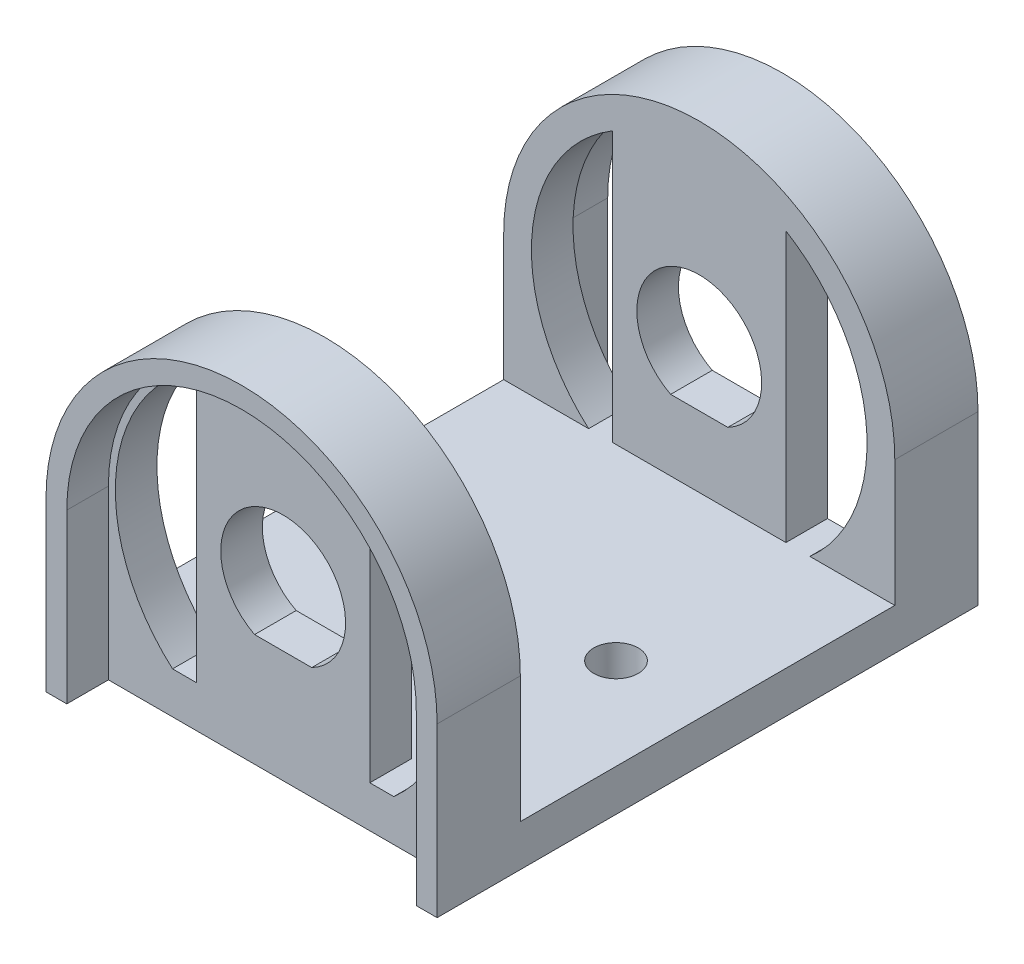
ISO-10303-21;
HEADER;
FILE_DESCRIPTION(('STEP AP214'),'2;1');
FILE_NAME('part.step','',(''),(''),'','','');
FILE_SCHEMA(('AUTOMOTIVE_DESIGN { 1 0 10303 214 1 1 1 1 }'));
ENDSEC;
DATA;
#1=APPLICATION_CONTEXT('core data for automotive mechanical design processes');
#2=APPLICATION_PROTOCOL_DEFINITION('international standard','automotive_design',2000,#1);
#3=PRODUCT_CONTEXT('',#1,'mechanical');
#4=PRODUCT('Part','Part','',(#3));
#5=PRODUCT_RELATED_PRODUCT_CATEGORY('part','',(#4));
#6=PRODUCT_DEFINITION_FORMATION('','',#4);
#7=PRODUCT_DEFINITION_CONTEXT('part definition',#1,'design');
#8=PRODUCT_DEFINITION('design','',#6,#7);
#9=PRODUCT_DEFINITION_SHAPE('','',#8);
#10=(LENGTH_UNIT() NAMED_UNIT(*) SI_UNIT(.MILLI.,.METRE.));
#11=(NAMED_UNIT(*) PLANE_ANGLE_UNIT() SI_UNIT($,.RADIAN.));
#12=(NAMED_UNIT(*) SI_UNIT($,.STERADIAN.) SOLID_ANGLE_UNIT());
#13=UNCERTAINTY_MEASURE_WITH_UNIT(LENGTH_MEASURE(1.E-05),#10,'distance_accuracy_value','');
#14=(GEOMETRIC_REPRESENTATION_CONTEXT(3) GLOBAL_UNCERTAINTY_ASSIGNED_CONTEXT((#13)) GLOBAL_UNIT_ASSIGNED_CONTEXT((#10,
#11,#12)) REPRESENTATION_CONTEXT('',''));
#15=CARTESIAN_POINT('',(0.,0.,0.));
#16=DIRECTION('',(0.,0.,1.));
#17=DIRECTION('',(1.,0.,0.));
#18=AXIS2_PLACEMENT_3D('',#15,#16,#17);
#19=CARTESIAN_POINT('',(0.,-10.1,19.5));
#20=DIRECTION('',(0.,-1.,0.));
#21=DIRECTION('',(0.,0.,-1.));
#22=AXIS2_PLACEMENT_3D('',#19,#20,#21);
#23=PLANE('',#22);
#24=CARTESIAN_POINT('',(7.5,-10.1,0.));
#25=DIRECTION('',(0.,-1.,0.));
#26=DIRECTION('',(0.,0.,-1.));
#27=AXIS2_PLACEMENT_3D('',#24,#25,#26);
#28=CIRCLE('',#27,1.6);
#29=CARTESIAN_POINT('',(7.5,-10.1,-1.6));
#30=VERTEX_POINT('',#29);
#31=EDGE_CURVE('E337',#30,#30,#28,.T.);
#32=ORIENTED_EDGE('',*,*,#31,.T.);
#33=EDGE_LOOP('',(#32));
#34=FACE_BOUND('',#33,.T.);
#35=CARTESIAN_POINT('',(-7.5,-10.1,0.));
#36=DIRECTION('',(0.,-1.,0.));
#37=DIRECTION('',(0.,0.,-1.));
#38=AXIS2_PLACEMENT_3D('',#35,#36,#37);
#39=CIRCLE('',#38,1.6);
#40=CARTESIAN_POINT('',(-7.5,-10.1,-1.6));
#41=VERTEX_POINT('',#40);
#42=EDGE_CURVE('E329',#41,#41,#39,.T.);
#43=ORIENTED_EDGE('',*,*,#42,.T.);
#44=EDGE_LOOP('',(#43));
#45=FACE_BOUND('',#44,.T.);
#46=DIRECTION('',(1.,0.,0.));
#47=VECTOR('',#46,1.);
#48=CARTESIAN_POINT('',(0.,-10.1,-16.5));
#49=LINE('',#48,#47);
#50=CARTESIAN_POINT('',(-7.97496081495075,-10.1,-16.5));
#51=VERTEX_POINT('',#50);
#52=CARTESIAN_POINT('',(-6.25,-10.1,-16.5));
#53=VERTEX_POINT('',#52);
#54=EDGE_CURVE('E59',#51,#53,#49,.T.);
#55=ORIENTED_EDGE('',*,*,#54,.F.);
#56=DIRECTION('',(0.,0.,-1.));
#57=VECTOR('',#56,1.);
#58=CARTESIAN_POINT('',(-7.97496081495075,-10.1,19.5));
#59=LINE('',#58,#57);
#60=CARTESIAN_POINT('',(-7.97496081495075,-10.1,-13.5));
#61=VERTEX_POINT('',#60);
#62=EDGE_CURVE('E549',#61,#51,#59,.T.);
#63=ORIENTED_EDGE('',*,*,#62,.F.);
#64=DIRECTION('',(1.,0.,0.));
#65=VECTOR('',#64,1.);
#66=CARTESIAN_POINT('',(-14.1,-10.1,-13.5));
#67=LINE('',#66,#65);
#68=CARTESIAN_POINT('',(-14.1,-10.1,-13.5));
#69=VERTEX_POINT('',#68);
#70=EDGE_CURVE('E430',#69,#61,#67,.T.);
#71=ORIENTED_EDGE('',*,*,#70,.F.);
#72=DIRECTION('',(0.,0.,-1.));
#73=VECTOR('',#72,1.);
#74=CARTESIAN_POINT('',(-14.1,-10.1,-13.5));
#75=LINE('',#74,#73);
#76=CARTESIAN_POINT('',(-14.1,-10.1,13.5));
#77=VERTEX_POINT('',#76);
#78=EDGE_CURVE('E421',#77,#69,#75,.T.);
#79=ORIENTED_EDGE('',*,*,#78,.F.);
#80=DIRECTION('',(1.,0.,0.));
#81=VECTOR('',#80,1.);
#82=CARTESIAN_POINT('',(-14.1,-10.1,13.5));
#83=LINE('',#82,#81);
#84=CARTESIAN_POINT('',(-7.97496081495075,-10.1,13.5));
#85=VERTEX_POINT('',#84);
#86=EDGE_CURVE('E436',#77,#85,#83,.T.);
#87=ORIENTED_EDGE('',*,*,#86,.T.);
#88=CARTESIAN_POINT('',(-7.97496081495075,-10.1,16.5));
#89=VERTEX_POINT('',#88);
#90=EDGE_CURVE('E545',#89,#85,#59,.T.);
#91=ORIENTED_EDGE('',*,*,#90,.F.);
#92=DIRECTION('',(-1.,0.,0.));
#93=VECTOR('',#92,1.);
#94=CARTESIAN_POINT('',(0.,-10.1,16.5));
#95=LINE('',#94,#93);
#96=CARTESIAN_POINT('',(-6.25,-10.1,16.5));
#97=VERTEX_POINT('',#96);
#98=EDGE_CURVE('E395',#97,#89,#95,.T.);
#99=ORIENTED_EDGE('',*,*,#98,.F.);
#100=DIRECTION('',(0.,0.,-1.));
#101=VECTOR('',#100,1.);
#102=CARTESIAN_POINT('',(-6.25,-10.1,19.5));
#103=LINE('',#102,#101);
#104=CARTESIAN_POINT('',(-6.25,-10.1,13.5));
#105=VERTEX_POINT('',#104);
#106=EDGE_CURVE('E550',#97,#105,#103,.T.);
#107=ORIENTED_EDGE('',*,*,#106,.T.);
#108=CARTESIAN_POINT('',(6.24999999999999,-10.1,13.5));
#109=VERTEX_POINT('',#108);
#110=EDGE_CURVE('E440',#105,#109,#83,.T.);
#111=ORIENTED_EDGE('',*,*,#110,.T.);
#112=DIRECTION('',(0.,0.,-1.));
#113=VECTOR('',#112,1.);
#114=CARTESIAN_POINT('',(6.25,-10.1,19.5));
#115=LINE('',#114,#113);
#116=CARTESIAN_POINT('',(6.25,-10.1,16.5));
#117=VERTEX_POINT('',#116);
#118=EDGE_CURVE('E539',#117,#109,#115,.T.);
#119=ORIENTED_EDGE('',*,*,#118,.F.);
#120=CARTESIAN_POINT('',(7.97496081495075,-10.1,16.5));
#121=VERTEX_POINT('',#120);
#122=EDGE_CURVE('E391',#121,#117,#95,.T.);
#123=ORIENTED_EDGE('',*,*,#122,.F.);
#124=DIRECTION('',(0.,0.,-1.));
#125=VECTOR('',#124,1.);
#126=CARTESIAN_POINT('',(7.97496081495075,-10.1,19.5));
#127=LINE('',#126,#125);
#128=CARTESIAN_POINT('',(7.97496081495074,-10.1,13.5));
#129=VERTEX_POINT('',#128);
#130=EDGE_CURVE('E521',#121,#129,#127,.T.);
#131=ORIENTED_EDGE('',*,*,#130,.T.);
#132=CARTESIAN_POINT('',(14.1,-10.1,13.5));
#133=VERTEX_POINT('',#132);
#134=EDGE_CURVE('E429',#129,#133,#83,.T.);
#135=ORIENTED_EDGE('',*,*,#134,.T.);
#136=DIRECTION('',(0.,0.,-1.));
#137=VECTOR('',#136,1.);
#138=CARTESIAN_POINT('',(14.1,-10.1,-13.5));
#139=LINE('',#138,#137);
#140=CARTESIAN_POINT('',(14.1,-10.1,-13.5));
#141=VERTEX_POINT('',#140);
#142=EDGE_CURVE('E409',#133,#141,#139,.T.);
#143=ORIENTED_EDGE('',*,*,#142,.T.);
#144=CARTESIAN_POINT('',(7.97496081495074,-10.1,-13.5));
#145=VERTEX_POINT('',#144);
#146=EDGE_CURVE('E435',#145,#141,#67,.T.);
#147=ORIENTED_EDGE('',*,*,#146,.F.);
#148=CARTESIAN_POINT('',(7.97496081495075,-10.1,-16.5));
#149=VERTEX_POINT('',#148);
#150=EDGE_CURVE('E542',#145,#149,#127,.T.);
#151=ORIENTED_EDGE('',*,*,#150,.T.);
#152=CARTESIAN_POINT('',(6.25,-10.1,-16.5));
#153=VERTEX_POINT('',#152);
#154=EDGE_CURVE('E315',#153,#149,#49,.T.);
#155=ORIENTED_EDGE('',*,*,#154,.F.);
#156=CARTESIAN_POINT('',(6.25,-10.1,-13.5));
#157=VERTEX_POINT('',#156);
#158=EDGE_CURVE('E537',#157,#153,#115,.T.);
#159=ORIENTED_EDGE('',*,*,#158,.F.);
#160=CARTESIAN_POINT('',(-6.25000000000001,-10.1,-13.5));
#161=VERTEX_POINT('',#160);
#162=EDGE_CURVE('E434',#161,#157,#67,.T.);
#163=ORIENTED_EDGE('',*,*,#162,.F.);
#164=EDGE_CURVE('E548',#161,#53,#103,.T.);
#165=ORIENTED_EDGE('',*,*,#164,.T.);
#166=EDGE_LOOP('',(#55,#63,#71,#79,#87,#91,#99,#107,#111,#119,#123,#131,#135,#143,#147,#151,
#155,#159,#163,#165));
#167=FACE_BOUND('',#166,.T.);
#168=ADVANCED_FACE('F43',(#34,#45,#167),#23,.F.);
#169=CARTESIAN_POINT('',(0.,-0.999999999999997,19.5));
#170=DIRECTION('',(0.,0.,-1.));
#171=DIRECTION('',(-1.,0.,0.));
#172=AXIS2_PLACEMENT_3D('',#169,#170,#171);
#173=CYLINDRICAL_SURFACE('',#172,12.1);
#174=DIRECTION('',(0.,0.,-1.));
#175=VECTOR('',#174,1.);
#176=CARTESIAN_POINT('',(6.25,9.36086386359747,19.5));
#177=LINE('',#176,#175);
#178=CARTESIAN_POINT('',(6.25,9.36086386359747,-13.5));
#179=VERTEX_POINT('',#178);
#180=CARTESIAN_POINT('',(6.25,9.36086386359747,-16.5));
#181=VERTEX_POINT('',#180);
#182=EDGE_CURVE('E538',#179,#181,#177,.T.);
#183=ORIENTED_EDGE('',*,*,#182,.T.);
#184=CARTESIAN_POINT('',(0.,-0.999999999999997,-16.5));
#185=DIRECTION('',(0.,0.,-1.));
#186=DIRECTION('',(-1.,0.,0.));
#187=AXIS2_PLACEMENT_3D('',#184,#185,#186);
#188=CIRCLE('',#187,12.1);
#189=EDGE_CURVE('E67',#181,#149,#188,.T.);
#190=ORIENTED_EDGE('',*,*,#189,.T.);
#191=ORIENTED_EDGE('',*,*,#150,.F.);
#192=CARTESIAN_POINT('',(0.,-0.999999999999997,-13.5));
#193=DIRECTION('',(0.,0.,-1.));
#194=DIRECTION('',(0.,1.,0.));
#195=AXIS2_PLACEMENT_3D('',#192,#193,#194);
#196=CIRCLE('',#195,12.1);
#197=EDGE_CURVE('E469',#179,#145,#196,.T.);
#198=ORIENTED_EDGE('',*,*,#197,.F.);
#199=EDGE_LOOP('',(#183,#190,#191,#198));
#200=FACE_BOUND('',#199,.T.);
#201=ADVANCED_FACE('F643',(#200),#173,.F.);
#202=CARTESIAN_POINT('',(0.,-0.999999999999997,19.5));
#203=DIRECTION('',(0.,0.,-1.));
#204=DIRECTION('',(-1.,0.,0.));
#205=AXIS2_PLACEMENT_3D('',#202,#203,#204);
#206=CYLINDRICAL_SURFACE('',#205,12.1);
#207=ORIENTED_EDGE('',*,*,#62,.T.);
#208=CARTESIAN_POINT('',(0.,-0.999999999999997,-16.5));
#209=DIRECTION('',(0.,0.,-1.));
#210=DIRECTION('',(-1.,0.,0.));
#211=AXIS2_PLACEMENT_3D('',#208,#209,#210);
#212=CIRCLE('',#211,12.1);
#213=CARTESIAN_POINT('',(-6.25,9.36086386359747,-16.5));
#214=VERTEX_POINT('',#213);
#215=EDGE_CURVE('E321',#51,#214,#212,.T.);
#216=ORIENTED_EDGE('',*,*,#215,.T.);
#217=DIRECTION('',(0.,0.,-1.));
#218=VECTOR('',#217,1.);
#219=CARTESIAN_POINT('',(-6.25,9.36086386359747,19.5));
#220=LINE('',#219,#218);
#221=CARTESIAN_POINT('',(-6.25,9.36086386359747,-13.5));
#222=VERTEX_POINT('',#221);
#223=EDGE_CURVE('E553',#222,#214,#220,.T.);
#224=ORIENTED_EDGE('',*,*,#223,.F.);
#225=CARTESIAN_POINT('',(0.,-0.999999999999997,-13.5));
#226=DIRECTION('',(0.,0.,-1.));
#227=DIRECTION('',(0.,1.,0.));
#228=AXIS2_PLACEMENT_3D('',#225,#226,#227);
#229=CIRCLE('',#228,12.1);
#230=EDGE_CURVE('E476',#61,#222,#229,.T.);
#231=ORIENTED_EDGE('',*,*,#230,.F.);
#232=EDGE_LOOP('',(#207,#216,#224,#231));
#233=FACE_BOUND('',#232,.T.);
#234=ADVANCED_FACE('F638',(#233),#206,.F.);
#235=CARTESIAN_POINT('',(-6.25,0.,19.5));
#236=DIRECTION('',(1.,0.,0.));
#237=DIRECTION('',(0.,1.,0.));
#238=AXIS2_PLACEMENT_3D('',#235,#236,#237);
#239=PLANE('',#238);
#240=DIRECTION('',(0.,1.,0.));
#241=VECTOR('',#240,1.);
#242=CARTESIAN_POINT('',(-6.25,0.,-16.5));
#243=LINE('',#242,#241);
#244=EDGE_CURVE('E318',#53,#214,#243,.T.);
#245=ORIENTED_EDGE('',*,*,#244,.F.);
#246=ORIENTED_EDGE('',*,*,#164,.F.);
#247=DIRECTION('',(0.,1.,0.));
#248=VECTOR('',#247,1.);
#249=CARTESIAN_POINT('',(-6.25,0.,-13.5));
#250=LINE('',#249,#248);
#251=EDGE_CURVE('E472',#161,#222,#250,.T.);
#252=ORIENTED_EDGE('',*,*,#251,.T.);
#253=ORIENTED_EDGE('',*,*,#223,.T.);
#254=EDGE_LOOP('',(#245,#246,#252,#253));
#255=FACE_BOUND('',#254,.T.);
#256=ADVANCED_FACE('F629',(#255),#239,.F.);
#257=CARTESIAN_POINT('',(0.,-0.999999999999869,19.5));
#258=DIRECTION('',(0.,0.,-1.));
#259=DIRECTION('',(-1.,0.,0.));
#260=AXIS2_PLACEMENT_3D('',#257,#258,#259);
#261=CYLINDRICAL_SURFACE('',#260,4.5);
#262=DIRECTION('',(0.,0.,-1.));
#263=VECTOR('',#262,1.);
#264=CARTESIAN_POINT('',(-2.06155281280883,-4.99999999999987,19.5));
#265=LINE('',#264,#263);
#266=CARTESIAN_POINT('',(-2.06155281280883,-4.99999999999987,-13.5));
#267=VERTEX_POINT('',#266);
#268=CARTESIAN_POINT('',(-2.06155281280883,-4.99999999999987,-16.5));
#269=VERTEX_POINT('',#268);
#270=EDGE_CURVE('E500',#267,#269,#265,.T.);
#271=ORIENTED_EDGE('',*,*,#270,.T.);
#272=CARTESIAN_POINT('',(0.,-0.999999999999869,-16.5));
#273=DIRECTION('',(0.,0.,-1.));
#274=DIRECTION('',(-1.,0.,0.));
#275=AXIS2_PLACEMENT_3D('',#272,#273,#274);
#276=CIRCLE('',#275,4.5);
#277=CARTESIAN_POINT('',(2.06155281280883,-4.99999999999987,-16.5));
#278=VERTEX_POINT('',#277);
#279=EDGE_CURVE('E306',#269,#278,#276,.T.);
#280=ORIENTED_EDGE('',*,*,#279,.T.);
#281=DIRECTION('',(0.,0.,-1.));
#282=VECTOR('',#281,1.);
#283=CARTESIAN_POINT('',(2.06155281280883,-4.99999999999987,19.5));
#284=LINE('',#283,#282);
#285=CARTESIAN_POINT('',(2.06155281280883,-4.99999999999987,-13.5));
#286=VERTEX_POINT('',#285);
#287=EDGE_CURVE('E560',#286,#278,#284,.T.);
#288=ORIENTED_EDGE('',*,*,#287,.F.);
#289=CARTESIAN_POINT('',(0.,-0.999999999999869,-13.5));
#290=DIRECTION('',(0.,0.,-1.));
#291=DIRECTION('',(0.,1.,0.));
#292=AXIS2_PLACEMENT_3D('',#289,#290,#291);
#293=CIRCLE('',#292,4.5);
#294=EDGE_CURVE('E463',#267,#286,#293,.T.);
#295=ORIENTED_EDGE('',*,*,#294,.F.);
#296=EDGE_LOOP('',(#271,#280,#288,#295));
#297=FACE_BOUND('',#296,.T.);
#298=ADVANCED_FACE('F635',(#297),#261,.F.);
#299=CARTESIAN_POINT('',(6.25,0.,19.5));
#300=DIRECTION('',(1.,0.,0.));
#301=DIRECTION('',(0.,1.,0.));
#302=AXIS2_PLACEMENT_3D('',#299,#300,#301);
#303=PLANE('',#302);
#304=ORIENTED_EDGE('',*,*,#158,.T.);
#305=DIRECTION('',(0.,1.,0.));
#306=VECTOR('',#305,1.);
#307=CARTESIAN_POINT('',(6.25,0.,-16.5));
#308=LINE('',#307,#306);
#309=EDGE_CURVE('E310',#153,#181,#308,.T.);
#310=ORIENTED_EDGE('',*,*,#309,.T.);
#311=ORIENTED_EDGE('',*,*,#182,.F.);
#312=DIRECTION('',(0.,1.,0.));
#313=VECTOR('',#312,1.);
#314=CARTESIAN_POINT('',(6.25,0.,-13.5));
#315=LINE('',#314,#313);
#316=EDGE_CURVE('E466',#157,#179,#315,.T.);
#317=ORIENTED_EDGE('',*,*,#316,.F.);
#318=EDGE_LOOP('',(#304,#310,#311,#317));
#319=FACE_BOUND('',#318,.T.);
#320=ADVANCED_FACE('F658',(#319),#303,.T.);
#321=CARTESIAN_POINT('',(0.,-4.99999999999987,19.5));
#322=DIRECTION('',(0.,-1.,0.));
#323=DIRECTION('',(0.,0.,-1.));
#324=AXIS2_PLACEMENT_3D('',#321,#322,#323);
#325=PLANE('',#324);
#326=DIRECTION('',(1.,0.,0.));
#327=VECTOR('',#326,1.);
#328=CARTESIAN_POINT('',(0.,-4.99999999999987,-16.5));
#329=LINE('',#328,#327);
#330=EDGE_CURVE('E298',#269,#278,#329,.T.);
#331=ORIENTED_EDGE('',*,*,#330,.F.);
#332=ORIENTED_EDGE('',*,*,#270,.F.);
#333=DIRECTION('',(1.,0.,0.));
#334=VECTOR('',#333,1.);
#335=CARTESIAN_POINT('',(0.,-4.99999999999987,-13.5));
#336=LINE('',#335,#334);
#337=EDGE_CURVE('E11',#267,#286,#336,.T.);
#338=ORIENTED_EDGE('',*,*,#337,.T.);
#339=ORIENTED_EDGE('',*,*,#287,.T.);
#340=EDGE_LOOP('',(#331,#332,#338,#339));
#341=FACE_BOUND('',#340,.T.);
#342=ADVANCED_FACE('F670',(#341),#325,.F.);
#343=CARTESIAN_POINT('',(0.,-13.1,19.5));
#344=DIRECTION('',(0.,1.,0.));
#345=DIRECTION('',(0.,0.,1.));
#346=AXIS2_PLACEMENT_3D('',#343,#344,#345);
#347=PLANE('',#346);
#348=CARTESIAN_POINT('',(-7.5,-13.1,0.));
#349=DIRECTION('',(0.,1.,0.));
#350=DIRECTION('',(0.,0.,-1.));
#351=AXIS2_PLACEMENT_3D('',#348,#349,#350);
#352=CIRCLE('',#351,1.6);
#353=CARTESIAN_POINT('',(-7.5,-13.1,-1.6));
#354=VERTEX_POINT('',#353);
#355=EDGE_CURVE('E330',#354,#354,#352,.T.);
#356=ORIENTED_EDGE('',*,*,#355,.T.);
#357=EDGE_LOOP('',(#356));
#358=FACE_BOUND('',#357,.T.);
#359=CARTESIAN_POINT('',(7.5,-13.1,0.));
#360=DIRECTION('',(0.,1.,0.));
#361=DIRECTION('',(0.,0.,1.));
#362=AXIS2_PLACEMENT_3D('',#359,#360,#361);
#363=CIRCLE('',#362,1.6);
#364=CARTESIAN_POINT('',(7.5,-13.1,1.6));
#365=VERTEX_POINT('',#364);
#366=EDGE_CURVE('E325',#365,#365,#363,.T.);
#367=ORIENTED_EDGE('',*,*,#366,.T.);
#368=EDGE_LOOP('',(#367));
#369=FACE_BOUND('',#368,.T.);
#370=DIRECTION('',(0.,0.,-1.));
#371=VECTOR('',#370,1.);
#372=CARTESIAN_POINT('',(-12.6,-13.1,-16.5));
#373=LINE('',#372,#371);
#374=CARTESIAN_POINT('',(-12.6,-13.1,-16.5));
#375=VERTEX_POINT('',#374);
#376=CARTESIAN_POINT('',(-12.6,-13.1,-19.5));
#377=VERTEX_POINT('',#376);
#378=EDGE_CURVE('E299',#375,#377,#373,.T.);
#379=ORIENTED_EDGE('',*,*,#378,.F.);
#380=DIRECTION('',(1.,0.,0.));
#381=VECTOR('',#380,1.);
#382=CARTESIAN_POINT('',(-12.6,-13.1,-16.5));
#383=LINE('',#382,#381);
#384=CARTESIAN_POINT('',(12.6,-13.1,-16.5));
#385=VERTEX_POINT('',#384);
#386=EDGE_CURVE('E265',#375,#385,#383,.T.);
#387=ORIENTED_EDGE('',*,*,#386,.T.);
#388=DIRECTION('',(0.,0.,-1.));
#389=VECTOR('',#388,1.);
#390=CARTESIAN_POINT('',(12.6,-13.1,-16.5));
#391=LINE('',#390,#389);
#392=CARTESIAN_POINT('',(12.6,-13.1,-19.5));
#393=VERTEX_POINT('',#392);
#394=EDGE_CURVE('E259',#385,#393,#391,.T.);
#395=ORIENTED_EDGE('',*,*,#394,.T.);
#396=DIRECTION('',(1.,0.,0.));
#397=VECTOR('',#396,1.);
#398=CARTESIAN_POINT('',(0.,-13.1,-19.5));
#399=LINE('',#398,#397);
#400=CARTESIAN_POINT('',(14.1,-13.1,-19.5));
#401=VERTEX_POINT('',#400);
#402=EDGE_CURVE('E512',#393,#401,#399,.T.);
#403=ORIENTED_EDGE('',*,*,#402,.T.);
#404=DIRECTION('',(0.,0.,-1.));
#405=VECTOR('',#404,1.);
#406=CARTESIAN_POINT('',(14.1,-13.1,19.5));
#407=LINE('',#406,#405);
#408=CARTESIAN_POINT('',(14.1,-13.1,19.5));
#409=VERTEX_POINT('',#408);
#410=EDGE_CURVE('E516',#409,#401,#407,.T.);
#411=ORIENTED_EDGE('',*,*,#410,.F.);
#412=DIRECTION('',(1.,0.,0.));
#413=VECTOR('',#412,1.);
#414=CARTESIAN_POINT('',(0.,-13.1,19.5));
#415=LINE('',#414,#413);
#416=CARTESIAN_POINT('',(12.6,-13.1,19.5));
#417=VERTEX_POINT('',#416);
#418=EDGE_CURVE('E495',#417,#409,#415,.T.);
#419=ORIENTED_EDGE('',*,*,#418,.F.);
#420=DIRECTION('',(0.,0.,1.));
#421=VECTOR('',#420,1.);
#422=CARTESIAN_POINT('',(12.6,-13.1,16.5));
#423=LINE('',#422,#421);
#424=CARTESIAN_POINT('',(12.6,-13.1,16.5));
#425=VERTEX_POINT('',#424);
#426=EDGE_CURVE('E371',#425,#417,#423,.T.);
#427=ORIENTED_EDGE('',*,*,#426,.F.);
#428=DIRECTION('',(1.,0.,0.));
#429=VECTOR('',#428,1.);
#430=CARTESIAN_POINT('',(-12.6,-13.1,16.5));
#431=LINE('',#430,#429);
#432=CARTESIAN_POINT('',(-12.6,-13.1,16.5));
#433=VERTEX_POINT('',#432);
#434=EDGE_CURVE('E351',#433,#425,#431,.T.);
#435=ORIENTED_EDGE('',*,*,#434,.F.);
#436=DIRECTION('',(0.,0.,1.));
#437=VECTOR('',#436,1.);
#438=CARTESIAN_POINT('',(-12.6,-13.1,16.5));
#439=LINE('',#438,#437);
#440=CARTESIAN_POINT('',(-12.6,-13.1,19.5));
#441=VERTEX_POINT('',#440);
#442=EDGE_CURVE('E374',#433,#441,#439,.T.);
#443=ORIENTED_EDGE('',*,*,#442,.T.);
#444=CARTESIAN_POINT('',(-14.1,-13.1,19.5));
#445=VERTEX_POINT('',#444);
#446=EDGE_CURVE('E496',#445,#441,#415,.T.);
#447=ORIENTED_EDGE('',*,*,#446,.F.);
#448=DIRECTION('',(0.,0.,-1.));
#449=VECTOR('',#448,1.);
#450=CARTESIAN_POINT('',(-14.1,-13.1,19.5));
#451=LINE('',#450,#449);
#452=CARTESIAN_POINT('',(-14.1,-13.1,-19.5));
#453=VERTEX_POINT('',#452);
#454=EDGE_CURVE('E520',#445,#453,#451,.T.);
#455=ORIENTED_EDGE('',*,*,#454,.T.);
#456=EDGE_CURVE('E488',#453,#377,#399,.T.);
#457=ORIENTED_EDGE('',*,*,#456,.T.);
#458=EDGE_LOOP('',(#379,#387,#395,#403,#411,#419,#427,#435,#443,#447,#455,#457));
#459=FACE_BOUND('',#458,.T.);
#460=ADVANCED_FACE('F667',(#358,#369,#459),#347,.F.);
#461=CARTESIAN_POINT('',(0.,0.,-19.5));
#462=DIRECTION('',(0.,0.,1.));
#463=DIRECTION('',(1.,0.,0.));
#464=AXIS2_PLACEMENT_3D('',#461,#462,#463);
#465=PLANE('',#464);
#466=DIRECTION('',(0.,-1.,0.));
#467=VECTOR('',#466,1.);
#468=CARTESIAN_POINT('',(-12.6,-1.00000000000008,-19.5));
#469=LINE('',#468,#467);
#470=CARTESIAN_POINT('',(-12.6,-1.00000000000008,-19.5));
#471=VERTEX_POINT('',#470);
#472=EDGE_CURVE('E280',#471,#377,#469,.T.);
#473=ORIENTED_EDGE('',*,*,#472,.T.);
#474=ORIENTED_EDGE('',*,*,#456,.F.);
#475=DIRECTION('',(0.,1.,0.));
#476=VECTOR('',#475,1.);
#477=CARTESIAN_POINT('',(-14.1,0.,-19.5));
#478=LINE('',#477,#476);
#479=CARTESIAN_POINT('',(-14.1,-0.999999999999999,-19.5));
#480=VERTEX_POINT('',#479);
#481=EDGE_CURVE('E508',#453,#480,#478,.T.);
#482=ORIENTED_EDGE('',*,*,#481,.T.);
#483=CARTESIAN_POINT('',(0.,-0.999999999999997,-19.5));
#484=DIRECTION('',(0.,0.,1.));
#485=DIRECTION('',(1.,0.,0.));
#486=AXIS2_PLACEMENT_3D('',#483,#484,#485);
#487=CIRCLE('',#486,14.1);
#488=CARTESIAN_POINT('',(14.1,-0.999999999999995,-19.5));
#489=VERTEX_POINT('',#488);
#490=EDGE_CURVE('E504',#489,#480,#487,.T.);
#491=ORIENTED_EDGE('',*,*,#490,.F.);
#492=DIRECTION('',(0.,1.,0.));
#493=VECTOR('',#492,1.);
#494=CARTESIAN_POINT('',(14.1,0.,-19.5));
#495=LINE('',#494,#493);
#496=EDGE_CURVE('E482',#401,#489,#495,.T.);
#497=ORIENTED_EDGE('',*,*,#496,.F.);
#498=ORIENTED_EDGE('',*,*,#402,.F.);
#499=DIRECTION('',(0.,1.,0.));
#500=VECTOR('',#499,1.);
#501=CARTESIAN_POINT('',(12.6,-0.999999999999997,-19.5));
#502=LINE('',#501,#500);
#503=CARTESIAN_POINT('',(12.6,-0.999999999999997,-19.5));
#504=VERTEX_POINT('',#503);
#505=EDGE_CURVE('E284',#393,#504,#502,.T.);
#506=ORIENTED_EDGE('',*,*,#505,.T.);
#507=CARTESIAN_POINT('',(0.,-0.999999999999997,-19.5));
#508=DIRECTION('',(0.,0.,1.));
#509=DIRECTION('',(1.,0.,0.));
#510=AXIS2_PLACEMENT_3D('',#507,#508,#509);
#511=CIRCLE('',#510,12.6);
#512=EDGE_CURVE('E274',#504,#471,#511,.T.);
#513=ORIENTED_EDGE('',*,*,#512,.T.);
#514=EDGE_LOOP('',(#473,#474,#482,#491,#497,#498,#506,#513));
#515=FACE_BOUND('',#514,.T.);
#516=ADVANCED_FACE('F653',(#515),#465,.F.);
#517=ORIENTED_EDGE('',*,*,#130,.F.);
#518=CARTESIAN_POINT('',(0.,-0.999999999999997,16.5));
#519=DIRECTION('',(0.,0.,1.));
#520=DIRECTION('',(1.,0.,0.));
#521=AXIS2_PLACEMENT_3D('',#518,#519,#520);
#522=CIRCLE('',#521,12.1);
#523=CARTESIAN_POINT('',(6.25,9.36086386359747,16.5));
#524=VERTEX_POINT('',#523);
#525=EDGE_CURVE('E394',#121,#524,#522,.T.);
#526=ORIENTED_EDGE('',*,*,#525,.T.);
#527=CARTESIAN_POINT('',(6.25,9.36086386359747,13.5));
#528=VERTEX_POINT('',#527);
#529=EDGE_CURVE('E534',#524,#528,#177,.T.);
#530=ORIENTED_EDGE('',*,*,#529,.T.);
#531=CARTESIAN_POINT('',(0.,-0.999999999999997,13.5));
#532=DIRECTION('',(0.,0.,1.));
#533=DIRECTION('',(0.,-1.,0.));
#534=AXIS2_PLACEMENT_3D('',#531,#532,#533);
#535=CIRCLE('',#534,12.1);
#536=EDGE_CURVE('E448',#129,#528,#535,.T.);
#537=ORIENTED_EDGE('',*,*,#536,.F.);
#538=EDGE_LOOP('',(#517,#526,#530,#537));
#539=FACE_BOUND('',#538,.T.);
#540=ADVANCED_FACE('F636',(#539),#173,.F.);
#541=CARTESIAN_POINT('',(-6.25,9.36086386359747,16.5));
#542=VERTEX_POINT('',#541);
#543=CARTESIAN_POINT('',(-6.25,9.36086386359747,13.5));
#544=VERTEX_POINT('',#543);
#545=EDGE_CURVE('E554',#542,#544,#220,.T.);
#546=ORIENTED_EDGE('',*,*,#545,.F.);
#547=CARTESIAN_POINT('',(0.,-0.999999999999997,16.5));
#548=DIRECTION('',(0.,0.,1.));
#549=DIRECTION('',(1.,0.,0.));
#550=AXIS2_PLACEMENT_3D('',#547,#548,#549);
#551=CIRCLE('',#550,12.1);
#552=EDGE_CURVE('E402',#542,#89,#551,.T.);
#553=ORIENTED_EDGE('',*,*,#552,.T.);
#554=ORIENTED_EDGE('',*,*,#90,.T.);
#555=CARTESIAN_POINT('',(0.,-0.999999999999997,13.5));
#556=DIRECTION('',(0.,0.,1.));
#557=DIRECTION('',(0.,-1.,0.));
#558=AXIS2_PLACEMENT_3D('',#555,#556,#557);
#559=CIRCLE('',#558,12.1);
#560=EDGE_CURVE('E456',#544,#85,#559,.T.);
#561=ORIENTED_EDGE('',*,*,#560,.F.);
#562=EDGE_LOOP('',(#546,#553,#554,#561));
#563=FACE_BOUND('',#562,.T.);
#564=ADVANCED_FACE('F593',(#563),#206,.F.);
#565=DIRECTION('',(0.,-1.,0.));
#566=VECTOR('',#565,1.);
#567=CARTESIAN_POINT('',(-6.25,0.,16.5));
#568=LINE('',#567,#566);
#569=EDGE_CURVE('E399',#542,#97,#568,.T.);
#570=ORIENTED_EDGE('',*,*,#569,.F.);
#571=ORIENTED_EDGE('',*,*,#545,.T.);
#572=DIRECTION('',(0.,-1.,0.));
#573=VECTOR('',#572,1.);
#574=CARTESIAN_POINT('',(-6.25,0.,13.5));
#575=LINE('',#574,#573);
#576=EDGE_CURVE('E452',#544,#105,#575,.T.);
#577=ORIENTED_EDGE('',*,*,#576,.T.);
#578=ORIENTED_EDGE('',*,*,#106,.F.);
#579=EDGE_LOOP('',(#570,#571,#577,#578));
#580=FACE_BOUND('',#579,.T.);
#581=ADVANCED_FACE('F626',(#580),#239,.F.);
#582=CARTESIAN_POINT('',(2.06155281280883,-4.99999999999987,16.5));
#583=VERTEX_POINT('',#582);
#584=CARTESIAN_POINT('',(2.06155281280883,-4.99999999999987,13.5));
#585=VERTEX_POINT('',#584);
#586=EDGE_CURVE('E561',#583,#585,#284,.T.);
#587=ORIENTED_EDGE('',*,*,#586,.F.);
#588=CARTESIAN_POINT('',(0.,-0.999999999999869,16.5));
#589=DIRECTION('',(0.,0.,1.));
#590=DIRECTION('',(1.,0.,0.));
#591=AXIS2_PLACEMENT_3D('',#588,#589,#590);
#592=CIRCLE('',#591,4.5);
#593=CARTESIAN_POINT('',(-2.06155281280883,-4.99999999999987,16.5));
#594=VERTEX_POINT('',#593);
#595=EDGE_CURVE('E383',#583,#594,#592,.T.);
#596=ORIENTED_EDGE('',*,*,#595,.T.);
#597=CARTESIAN_POINT('',(-2.06155281280883,-4.99999999999987,13.5));
#598=VERTEX_POINT('',#597);
#599=EDGE_CURVE('E557',#594,#598,#265,.T.);
#600=ORIENTED_EDGE('',*,*,#599,.T.);
#601=CARTESIAN_POINT('',(0.,-0.999999999999869,13.5));
#602=DIRECTION('',(0.,0.,1.));
#603=DIRECTION('',(0.,-1.,0.));
#604=AXIS2_PLACEMENT_3D('',#601,#602,#603);
#605=CIRCLE('',#604,4.5);
#606=EDGE_CURVE('E433',#585,#598,#605,.T.);
#607=ORIENTED_EDGE('',*,*,#606,.F.);
#608=EDGE_LOOP('',(#587,#596,#600,#607));
#609=FACE_BOUND('',#608,.T.);
#610=ADVANCED_FACE('F45',(#609),#261,.F.);
#611=ORIENTED_EDGE('',*,*,#529,.F.);
#612=DIRECTION('',(0.,-1.,0.));
#613=VECTOR('',#612,1.);
#614=CARTESIAN_POINT('',(6.25,0.,16.5));
#615=LINE('',#614,#613);
#616=EDGE_CURVE('E387',#524,#117,#615,.T.);
#617=ORIENTED_EDGE('',*,*,#616,.T.);
#618=ORIENTED_EDGE('',*,*,#118,.T.);
#619=DIRECTION('',(0.,-1.,0.));
#620=VECTOR('',#619,1.);
#621=CARTESIAN_POINT('',(6.25,0.,13.5));
#622=LINE('',#621,#620);
#623=EDGE_CURVE('E444',#528,#109,#622,.T.);
#624=ORIENTED_EDGE('',*,*,#623,.F.);
#625=EDGE_LOOP('',(#611,#617,#618,#624));
#626=FACE_BOUND('',#625,.T.);
#627=ADVANCED_FACE('F634',(#626),#303,.T.);
#628=DIRECTION('',(-1.,0.,0.));
#629=VECTOR('',#628,1.);
#630=CARTESIAN_POINT('',(0.,-4.99999999999987,16.5));
#631=LINE('',#630,#629);
#632=EDGE_CURVE('E370',#583,#594,#631,.T.);
#633=ORIENTED_EDGE('',*,*,#632,.F.);
#634=ORIENTED_EDGE('',*,*,#586,.T.);
#635=DIRECTION('',(-1.,0.,0.));
#636=VECTOR('',#635,1.);
#637=CARTESIAN_POINT('',(0.,-4.99999999999987,13.5));
#638=LINE('',#637,#636);
#639=EDGE_CURVE('E52',#585,#598,#638,.T.);
#640=ORIENTED_EDGE('',*,*,#639,.T.);
#641=ORIENTED_EDGE('',*,*,#599,.F.);
#642=EDGE_LOOP('',(#633,#634,#640,#641));
#643=FACE_BOUND('',#642,.T.);
#644=ADVANCED_FACE('F569',(#643),#325,.F.);
#645=CARTESIAN_POINT('',(0.,-0.999999999999997,19.5));
#646=DIRECTION('',(0.,0.,-1.));
#647=DIRECTION('',(-1.,0.,0.));
#648=AXIS2_PLACEMENT_3D('',#645,#646,#647);
#649=CYLINDRICAL_SURFACE('',#648,14.1);
#650=CARTESIAN_POINT('',(0.,-0.999999999999997,-13.5));
#651=DIRECTION('',(0.,0.,-1.));
#652=DIRECTION('',(0.,1.,0.));
#653=AXIS2_PLACEMENT_3D('',#650,#651,#652);
#654=CIRCLE('',#653,14.1);
#655=CARTESIAN_POINT('',(-14.1,-0.999999999999999,-13.5));
#656=VERTEX_POINT('',#655);
#657=CARTESIAN_POINT('',(14.1,-0.999999999999997,-13.5));
#658=VERTEX_POINT('',#657);
#659=EDGE_CURVE('E479',#656,#658,#654,.T.);
#660=ORIENTED_EDGE('',*,*,#659,.T.);
#661=DIRECTION('',(0.,0.,-1.));
#662=VECTOR('',#661,1.);
#663=CARTESIAN_POINT('',(14.1,-0.999999999999995,19.5));
#664=LINE('',#663,#662);
#665=EDGE_CURVE('E529',#658,#489,#664,.T.);
#666=ORIENTED_EDGE('',*,*,#665,.T.);
#667=ORIENTED_EDGE('',*,*,#490,.T.);
#668=DIRECTION('',(0.,0.,-1.));
#669=VECTOR('',#668,1.);
#670=CARTESIAN_POINT('',(-14.1,-0.999999999999999,19.5));
#671=LINE('',#670,#669);
#672=EDGE_CURVE('E524',#656,#480,#671,.T.);
#673=ORIENTED_EDGE('',*,*,#672,.F.);
#674=EDGE_LOOP('',(#660,#666,#667,#673));
#675=FACE_BOUND('',#674,.T.);
#676=ADVANCED_FACE('F661',(#675),#649,.T.);
#677=CARTESIAN_POINT('',(14.1,0.,19.5));
#678=DIRECTION('',(-1.,0.,0.));
#679=DIRECTION('',(0.,-1.,0.));
#680=AXIS2_PLACEMENT_3D('',#677,#678,#679);
#681=PLANE('',#680);
#682=ORIENTED_EDGE('',*,*,#665,.F.);
#683=DIRECTION('',(0.,1.,0.));
#684=VECTOR('',#683,1.);
#685=CARTESIAN_POINT('',(14.1,13.1,-13.5));
#686=LINE('',#685,#684);
#687=EDGE_CURVE('E413',#141,#658,#686,.T.);
#688=ORIENTED_EDGE('',*,*,#687,.F.);
#689=ORIENTED_EDGE('',*,*,#142,.F.);
#690=DIRECTION('',(0.,-1.,0.));
#691=VECTOR('',#690,1.);
#692=CARTESIAN_POINT('',(14.1,13.1,13.5));
#693=LINE('',#692,#691);
#694=CARTESIAN_POINT('',(14.1,-0.999999999999997,13.5));
#695=VERTEX_POINT('',#694);
#696=EDGE_CURVE('E406',#695,#133,#693,.T.);
#697=ORIENTED_EDGE('',*,*,#696,.F.);
#698=CARTESIAN_POINT('',(14.1,-0.999999999999995,19.5));
#699=VERTEX_POINT('',#698);
#700=EDGE_CURVE('E530',#699,#695,#664,.T.);
#701=ORIENTED_EDGE('',*,*,#700,.F.);
#702=DIRECTION('',(0.,1.,0.));
#703=VECTOR('',#702,1.);
#704=CARTESIAN_POINT('',(14.1,0.,19.5));
#705=LINE('',#704,#703);
#706=EDGE_CURVE('E483',#409,#699,#705,.T.);
#707=ORIENTED_EDGE('',*,*,#706,.F.);
#708=ORIENTED_EDGE('',*,*,#410,.T.);
#709=ORIENTED_EDGE('',*,*,#496,.T.);
#710=EDGE_LOOP('',(#682,#688,#689,#697,#701,#707,#708,#709));
#711=FACE_BOUND('',#710,.T.);
#712=ADVANCED_FACE('F611',(#711),#681,.F.);
#713=ORIENTED_EDGE('',*,*,#700,.T.);
#714=CARTESIAN_POINT('',(0.,-0.999999999999997,13.5));
#715=DIRECTION('',(0.,0.,1.));
#716=DIRECTION('',(0.,-1.,0.));
#717=AXIS2_PLACEMENT_3D('',#714,#715,#716);
#718=CIRCLE('',#717,14.1);
#719=CARTESIAN_POINT('',(-14.1,-0.999999999999999,13.5));
#720=VERTEX_POINT('',#719);
#721=EDGE_CURVE('E460',#695,#720,#718,.T.);
#722=ORIENTED_EDGE('',*,*,#721,.T.);
#723=CARTESIAN_POINT('',(-14.1,-0.999999999999999,19.5));
#724=VERTEX_POINT('',#723);
#725=EDGE_CURVE('E525',#724,#720,#671,.T.);
#726=ORIENTED_EDGE('',*,*,#725,.F.);
#727=CARTESIAN_POINT('',(0.,-0.999999999999997,19.5));
#728=DIRECTION('',(0.,0.,1.));
#729=DIRECTION('',(1.,0.,0.));
#730=AXIS2_PLACEMENT_3D('',#727,#728,#729);
#731=CIRCLE('',#730,14.1);
#732=EDGE_CURVE('E487',#699,#724,#731,.T.);
#733=ORIENTED_EDGE('',*,*,#732,.F.);
#734=EDGE_LOOP('',(#713,#722,#726,#733));
#735=FACE_BOUND('',#734,.T.);
#736=ADVANCED_FACE('F603',(#735),#649,.T.);
#737=CARTESIAN_POINT('',(-14.1,0.,19.5));
#738=DIRECTION('',(-1.,0.,0.));
#739=DIRECTION('',(0.,-1.,0.));
#740=AXIS2_PLACEMENT_3D('',#737,#738,#739);
#741=PLANE('',#740);
#742=DIRECTION('',(0.,1.,0.));
#743=VECTOR('',#742,1.);
#744=CARTESIAN_POINT('',(-14.1,13.1,-13.5));
#745=LINE('',#744,#743);
#746=EDGE_CURVE('E425',#69,#656,#745,.T.);
#747=ORIENTED_EDGE('',*,*,#746,.T.);
#748=ORIENTED_EDGE('',*,*,#672,.T.);
#749=ORIENTED_EDGE('',*,*,#481,.F.);
#750=ORIENTED_EDGE('',*,*,#454,.F.);
#751=DIRECTION('',(0.,1.,0.));
#752=VECTOR('',#751,1.);
#753=CARTESIAN_POINT('',(-14.1,0.,19.5));
#754=LINE('',#753,#752);
#755=EDGE_CURVE('E491',#445,#724,#754,.T.);
#756=ORIENTED_EDGE('',*,*,#755,.T.);
#757=ORIENTED_EDGE('',*,*,#725,.T.);
#758=DIRECTION('',(0.,-1.,0.));
#759=VECTOR('',#758,1.);
#760=CARTESIAN_POINT('',(-14.1,13.1,13.5));
#761=LINE('',#760,#759);
#762=EDGE_CURVE('E417',#720,#77,#761,.T.);
#763=ORIENTED_EDGE('',*,*,#762,.T.);
#764=ORIENTED_EDGE('',*,*,#78,.T.);
#765=EDGE_LOOP('',(#747,#748,#749,#750,#756,#757,#763,#764));
#766=FACE_BOUND('',#765,.T.);
#767=ADVANCED_FACE('F599',(#766),#741,.T.);
#768=CARTESIAN_POINT('',(0.,0.,19.5));
#769=DIRECTION('',(0.,0.,1.));
#770=DIRECTION('',(1.,0.,0.));
#771=AXIS2_PLACEMENT_3D('',#768,#769,#770);
#772=PLANE('',#771);
#773=DIRECTION('',(0.,1.,0.));
#774=VECTOR('',#773,1.);
#775=CARTESIAN_POINT('',(12.6,-0.999999999999997,19.5));
#776=LINE('',#775,#774);
#777=CARTESIAN_POINT('',(12.6,-0.999999999999997,19.5));
#778=VERTEX_POINT('',#777);
#779=EDGE_CURVE('E347',#417,#778,#776,.T.);
#780=ORIENTED_EDGE('',*,*,#779,.F.);
#781=ORIENTED_EDGE('',*,*,#418,.T.);
#782=ORIENTED_EDGE('',*,*,#706,.T.);
#783=ORIENTED_EDGE('',*,*,#732,.T.);
#784=ORIENTED_EDGE('',*,*,#755,.F.);
#785=ORIENTED_EDGE('',*,*,#446,.T.);
#786=DIRECTION('',(0.,-1.,0.));
#787=VECTOR('',#786,1.);
#788=CARTESIAN_POINT('',(-12.6,-1.00000000000008,19.5));
#789=LINE('',#788,#787);
#790=CARTESIAN_POINT('',(-12.6,-1.00000000000008,19.5));
#791=VERTEX_POINT('',#790);
#792=EDGE_CURVE('E361',#791,#441,#789,.T.);
#793=ORIENTED_EDGE('',*,*,#792,.F.);
#794=CARTESIAN_POINT('',(0.,-0.999999999999997,19.5));
#795=DIRECTION('',(0.,0.,1.));
#796=DIRECTION('',(1.,0.,0.));
#797=AXIS2_PLACEMENT_3D('',#794,#795,#796);
#798=CIRCLE('',#797,12.6);
#799=EDGE_CURVE('E341',#778,#791,#798,.T.);
#800=ORIENTED_EDGE('',*,*,#799,.F.);
#801=EDGE_LOOP('',(#780,#781,#782,#783,#784,#785,#793,#800));
#802=FACE_BOUND('',#801,.T.);
#803=ADVANCED_FACE('F666',(#802),#772,.T.);
#804=CARTESIAN_POINT('',(-14.1,13.1,-13.5));
#805=DIRECTION('',(0.,0.,-1.));
#806=DIRECTION('',(0.,1.,0.));
#807=AXIS2_PLACEMENT_3D('',#804,#805,#806);
#808=PLANE('',#807);
#809=ORIENTED_EDGE('',*,*,#294,.T.);
#810=ORIENTED_EDGE('',*,*,#337,.F.);
#811=EDGE_LOOP('',(#809,#810));
#812=FACE_BOUND('',#811,.T.);
#813=ORIENTED_EDGE('',*,*,#659,.F.);
#814=ORIENTED_EDGE('',*,*,#746,.F.);
#815=ORIENTED_EDGE('',*,*,#70,.T.);
#816=ORIENTED_EDGE('',*,*,#230,.T.);
#817=ORIENTED_EDGE('',*,*,#251,.F.);
#818=ORIENTED_EDGE('',*,*,#162,.T.);
#819=ORIENTED_EDGE('',*,*,#316,.T.);
#820=ORIENTED_EDGE('',*,*,#197,.T.);
#821=ORIENTED_EDGE('',*,*,#146,.T.);
#822=ORIENTED_EDGE('',*,*,#687,.T.);
#823=EDGE_LOOP('',(#813,#814,#815,#816,#817,#818,#819,#820,#821,#822));
#824=FACE_BOUND('',#823,.T.);
#825=ADVANCED_FACE('F677',(#812,#824),#808,.F.);
#826=CARTESIAN_POINT('',(-14.1,13.1,13.5));
#827=DIRECTION('',(0.,0.,1.));
#828=DIRECTION('',(0.,-1.,0.));
#829=AXIS2_PLACEMENT_3D('',#826,#827,#828);
#830=PLANE('',#829);
#831=ORIENTED_EDGE('',*,*,#606,.T.);
#832=ORIENTED_EDGE('',*,*,#639,.F.);
#833=EDGE_LOOP('',(#831,#832));
#834=FACE_BOUND('',#833,.T.);
#835=ORIENTED_EDGE('',*,*,#696,.T.);
#836=ORIENTED_EDGE('',*,*,#134,.F.);
#837=ORIENTED_EDGE('',*,*,#536,.T.);
#838=ORIENTED_EDGE('',*,*,#623,.T.);
#839=ORIENTED_EDGE('',*,*,#110,.F.);
#840=ORIENTED_EDGE('',*,*,#576,.F.);
#841=ORIENTED_EDGE('',*,*,#560,.T.);
#842=ORIENTED_EDGE('',*,*,#86,.F.);
#843=ORIENTED_EDGE('',*,*,#762,.F.);
#844=ORIENTED_EDGE('',*,*,#721,.F.);
#845=EDGE_LOOP('',(#835,#836,#837,#838,#839,#840,#841,#842,#843,#844));
#846=FACE_BOUND('',#845,.T.);
#847=ADVANCED_FACE('F573',(#834,#846),#830,.F.);
#848=CARTESIAN_POINT('',(0.,-0.999999999999997,16.5));
#849=DIRECTION('',(0.,0.,1.));
#850=DIRECTION('',(1.,0.,0.));
#851=AXIS2_PLACEMENT_3D('',#848,#849,#850);
#852=PLANE('',#851);
#853=CARTESIAN_POINT('',(0.,-0.999999999999997,16.5));
#854=DIRECTION('',(0.,0.,1.));
#855=DIRECTION('',(1.,0.,0.));
#856=AXIS2_PLACEMENT_3D('',#853,#854,#855);
#857=CIRCLE('',#856,12.6);
#858=CARTESIAN_POINT('',(12.6,-0.999999999999997,16.5));
#859=VERTEX_POINT('',#858);
#860=CARTESIAN_POINT('',(-12.6,-1.00000000000008,16.5));
#861=VERTEX_POINT('',#860);
#862=EDGE_CURVE('E342',#859,#861,#857,.T.);
#863=ORIENTED_EDGE('',*,*,#862,.T.);
#864=DIRECTION('',(0.,-1.,0.));
#865=VECTOR('',#864,1.);
#866=CARTESIAN_POINT('',(-12.6,-1.00000000000008,16.5));
#867=LINE('',#866,#865);
#868=EDGE_CURVE('E346',#861,#433,#867,.T.);
#869=ORIENTED_EDGE('',*,*,#868,.T.);
#870=ORIENTED_EDGE('',*,*,#434,.T.);
#871=DIRECTION('',(0.,1.,0.));
#872=VECTOR('',#871,1.);
#873=CARTESIAN_POINT('',(12.6,-0.999999999999997,16.5));
#874=LINE('',#873,#872);
#875=EDGE_CURVE('E354',#425,#859,#874,.T.);
#876=ORIENTED_EDGE('',*,*,#875,.T.);
#877=EDGE_LOOP('',(#863,#869,#870,#876));
#878=FACE_BOUND('',#877,.T.);
#879=ORIENTED_EDGE('',*,*,#632,.T.);
#880=ORIENTED_EDGE('',*,*,#595,.F.);
#881=EDGE_LOOP('',(#879,#880));
#882=FACE_BOUND('',#881,.T.);
#883=ORIENTED_EDGE('',*,*,#122,.T.);
#884=ORIENTED_EDGE('',*,*,#616,.F.);
#885=ORIENTED_EDGE('',*,*,#525,.F.);
#886=EDGE_LOOP('',(#883,#884,#885));
#887=FACE_BOUND('',#886,.T.);
#888=ORIENTED_EDGE('',*,*,#98,.T.);
#889=ORIENTED_EDGE('',*,*,#552,.F.);
#890=ORIENTED_EDGE('',*,*,#569,.T.);
#891=EDGE_LOOP('',(#888,#889,#890));
#892=FACE_BOUND('',#891,.T.);
#893=ADVANCED_FACE('F577',(#878,#882,#887,#892),#852,.T.);
#894=CARTESIAN_POINT('',(0.,-0.999999999999997,16.5));
#895=DIRECTION('',(0.,0.,1.));
#896=DIRECTION('',(1.,0.,0.));
#897=AXIS2_PLACEMENT_3D('',#894,#895,#896);
#898=CYLINDRICAL_SURFACE('',#897,12.6);
#899=ORIENTED_EDGE('',*,*,#799,.T.);
#900=DIRECTION('',(0.,0.,1.));
#901=VECTOR('',#900,1.);
#902=CARTESIAN_POINT('',(-12.6,-1.00000000000008,16.5));
#903=LINE('',#902,#901);
#904=EDGE_CURVE('E358',#861,#791,#903,.T.);
#905=ORIENTED_EDGE('',*,*,#904,.F.);
#906=ORIENTED_EDGE('',*,*,#862,.F.);
#907=DIRECTION('',(0.,0.,1.));
#908=VECTOR('',#907,1.);
#909=CARTESIAN_POINT('',(12.6,-0.999999999999997,16.5));
#910=LINE('',#909,#908);
#911=EDGE_CURVE('E367',#859,#778,#910,.T.);
#912=ORIENTED_EDGE('',*,*,#911,.T.);
#913=EDGE_LOOP('',(#899,#905,#906,#912));
#914=FACE_BOUND('',#913,.T.);
#915=ADVANCED_FACE('F580',(#914),#898,.F.);
#916=CARTESIAN_POINT('',(12.6,-0.999999999999997,16.5));
#917=DIRECTION('',(1.,0.,0.));
#918=DIRECTION('',(0.,0.,-1.));
#919=AXIS2_PLACEMENT_3D('',#916,#917,#918);
#920=PLANE('',#919);
#921=ORIENTED_EDGE('',*,*,#779,.T.);
#922=ORIENTED_EDGE('',*,*,#911,.F.);
#923=ORIENTED_EDGE('',*,*,#875,.F.);
#924=ORIENTED_EDGE('',*,*,#426,.T.);
#925=EDGE_LOOP('',(#921,#922,#923,#924));
#926=FACE_BOUND('',#925,.T.);
#927=ADVANCED_FACE('F686',(#926),#920,.F.);
#928=CARTESIAN_POINT('',(-12.6,-1.00000000000008,16.5));
#929=DIRECTION('',(-1.,0.,0.));
#930=DIRECTION('',(0.,0.,1.));
#931=AXIS2_PLACEMENT_3D('',#928,#929,#930);
#932=PLANE('',#931);
#933=ORIENTED_EDGE('',*,*,#792,.T.);
#934=ORIENTED_EDGE('',*,*,#442,.F.);
#935=ORIENTED_EDGE('',*,*,#868,.F.);
#936=ORIENTED_EDGE('',*,*,#904,.T.);
#937=EDGE_LOOP('',(#933,#934,#935,#936));
#938=FACE_BOUND('',#937,.T.);
#939=ADVANCED_FACE('F688',(#938),#932,.F.);
#940=CARTESIAN_POINT('',(-7.5,-13.1,0.));
#941=DIRECTION('',(0.,1.,0.));
#942=DIRECTION('',(0.,0.,1.));
#943=AXIS2_PLACEMENT_3D('',#940,#941,#942);
#944=CYLINDRICAL_SURFACE('',#943,1.6);
#945=ORIENTED_EDGE('',*,*,#355,.F.);
#946=EDGE_LOOP('',(#945));
#947=FACE_BOUND('',#946,.T.);
#948=ORIENTED_EDGE('',*,*,#42,.F.);
#949=EDGE_LOOP('',(#948));
#950=FACE_BOUND('',#949,.T.);
#951=ADVANCED_FACE('F691',(#947,#950),#944,.F.);
#952=CARTESIAN_POINT('',(7.5,-13.1,0.));
#953=DIRECTION('',(0.,1.,0.));
#954=DIRECTION('',(0.,0.,1.));
#955=AXIS2_PLACEMENT_3D('',#952,#953,#954);
#956=CYLINDRICAL_SURFACE('',#955,1.6);
#957=ORIENTED_EDGE('',*,*,#366,.F.);
#958=EDGE_LOOP('',(#957));
#959=FACE_BOUND('',#958,.T.);
#960=ORIENTED_EDGE('',*,*,#31,.F.);
#961=EDGE_LOOP('',(#960));
#962=FACE_BOUND('',#961,.T.);
#963=ADVANCED_FACE('F698',(#959,#962),#956,.F.);
#964=CARTESIAN_POINT('',(0.,-0.999999999999997,-16.5));
#965=DIRECTION('',(0.,0.,-1.));
#966=DIRECTION('',(1.,0.,0.));
#967=AXIS2_PLACEMENT_3D('',#964,#965,#966);
#968=PLANE('',#967);
#969=ORIENTED_EDGE('',*,*,#154,.T.);
#970=ORIENTED_EDGE('',*,*,#189,.F.);
#971=ORIENTED_EDGE('',*,*,#309,.F.);
#972=EDGE_LOOP('',(#969,#970,#971));
#973=FACE_BOUND('',#972,.T.);
#974=ORIENTED_EDGE('',*,*,#330,.T.);
#975=ORIENTED_EDGE('',*,*,#279,.F.);
#976=EDGE_LOOP('',(#974,#975));
#977=FACE_BOUND('',#976,.T.);
#978=CARTESIAN_POINT('',(0.,-0.999999999999997,-16.5));
#979=DIRECTION('',(0.,0.,1.));
#980=DIRECTION('',(1.,0.,0.));
#981=AXIS2_PLACEMENT_3D('',#978,#979,#980);
#982=CIRCLE('',#981,12.6);
#983=CARTESIAN_POINT('',(12.6,-0.999999999999997,-16.5));
#984=VERTEX_POINT('',#983);
#985=CARTESIAN_POINT('',(-12.6,-1.00000000000008,-16.5));
#986=VERTEX_POINT('',#985);
#987=EDGE_CURVE('E266',#984,#986,#982,.T.);
#988=ORIENTED_EDGE('',*,*,#987,.F.);
#989=DIRECTION('',(0.,1.,0.));
#990=VECTOR('',#989,1.);
#991=CARTESIAN_POINT('',(12.6,-0.999999999999997,-16.5));
#992=LINE('',#991,#990);
#993=EDGE_CURVE('E253',#385,#984,#992,.T.);
#994=ORIENTED_EDGE('',*,*,#993,.F.);
#995=ORIENTED_EDGE('',*,*,#386,.F.);
#996=DIRECTION('',(0.,-1.,0.));
#997=VECTOR('',#996,1.);
#998=CARTESIAN_POINT('',(-12.6,-1.00000000000008,-16.5));
#999=LINE('',#998,#997);
#1000=EDGE_CURVE('E276',#986,#375,#999,.T.);
#1001=ORIENTED_EDGE('',*,*,#1000,.F.);
#1002=EDGE_LOOP('',(#988,#994,#995,#1001));
#1003=FACE_BOUND('',#1002,.T.);
#1004=ORIENTED_EDGE('',*,*,#54,.T.);
#1005=ORIENTED_EDGE('',*,*,#244,.T.);
#1006=ORIENTED_EDGE('',*,*,#215,.F.);
#1007=EDGE_LOOP('',(#1004,#1005,#1006));
#1008=FACE_BOUND('',#1007,.T.);
#1009=ADVANCED_FACE('F278',(#973,#977,#1003,#1008),#968,.T.);
#1010=CARTESIAN_POINT('',(0.,-0.999999999999997,-16.5));
#1011=DIRECTION('',(0.,0.,-1.));
#1012=DIRECTION('',(-1.,0.,0.));
#1013=AXIS2_PLACEMENT_3D('',#1010,#1011,#1012);
#1014=CYLINDRICAL_SURFACE('',#1013,12.6);
#1015=ORIENTED_EDGE('',*,*,#512,.F.);
#1016=DIRECTION('',(0.,0.,-1.));
#1017=VECTOR('',#1016,1.);
#1018=CARTESIAN_POINT('',(12.6,-0.999999999999997,-16.5));
#1019=LINE('',#1018,#1017);
#1020=EDGE_CURVE('E256',#984,#504,#1019,.T.);
#1021=ORIENTED_EDGE('',*,*,#1020,.F.);
#1022=ORIENTED_EDGE('',*,*,#987,.T.);
#1023=DIRECTION('',(0.,0.,-1.));
#1024=VECTOR('',#1023,1.);
#1025=CARTESIAN_POINT('',(-12.6,-1.00000000000008,-16.5));
#1026=LINE('',#1025,#1024);
#1027=EDGE_CURVE('E295',#986,#471,#1026,.T.);
#1028=ORIENTED_EDGE('',*,*,#1027,.T.);
#1029=EDGE_LOOP('',(#1015,#1021,#1022,#1028));
#1030=FACE_BOUND('',#1029,.T.);
#1031=ADVANCED_FACE('F270',(#1030),#1014,.F.);
#1032=CARTESIAN_POINT('',(-12.6,-1.00000000000008,-16.5));
#1033=DIRECTION('',(1.,0.,0.));
#1034=DIRECTION('',(0.,0.,-1.));
#1035=AXIS2_PLACEMENT_3D('',#1032,#1033,#1034);
#1036=PLANE('',#1035);
#1037=ORIENTED_EDGE('',*,*,#472,.F.);
#1038=ORIENTED_EDGE('',*,*,#1027,.F.);
#1039=ORIENTED_EDGE('',*,*,#1000,.T.);
#1040=ORIENTED_EDGE('',*,*,#378,.T.);
#1041=EDGE_LOOP('',(#1037,#1038,#1039,#1040));
#1042=FACE_BOUND('',#1041,.T.);
#1043=ADVANCED_FACE('F705',(#1042),#1036,.T.);
#1044=CARTESIAN_POINT('',(12.6,-0.999999999999997,-16.5));
#1045=DIRECTION('',(-1.,0.,0.));
#1046=DIRECTION('',(0.,0.,1.));
#1047=AXIS2_PLACEMENT_3D('',#1044,#1045,#1046);
#1048=PLANE('',#1047);
#1049=ORIENTED_EDGE('',*,*,#505,.F.);
#1050=ORIENTED_EDGE('',*,*,#394,.F.);
#1051=ORIENTED_EDGE('',*,*,#993,.T.);
#1052=ORIENTED_EDGE('',*,*,#1020,.T.);
#1053=EDGE_LOOP('',(#1049,#1050,#1051,#1052));
#1054=FACE_BOUND('',#1053,.T.);
#1055=ADVANCED_FACE('F255',(#1054),#1048,.T.);
#1056=CLOSED_SHELL('',(#168,#201,#234,#256,#298,#320,#342,#460,#516,#540,#564,#581,#610,#627,
#644,#676,#712,#736,#767,#803,#825,#847,#893,#915,#927,#939,#951,#963,#1009,#1031,#1043,#1055));
#1057=MANIFOLD_SOLID_BREP('B2',#1056);
#1058=ADVANCED_BREP_SHAPE_REPRESENTATION('',(#18,#1057),#14);
#1059=SHAPE_DEFINITION_REPRESENTATION(#9,#1058);
ENDSEC;
END-ISO-10303-21;
